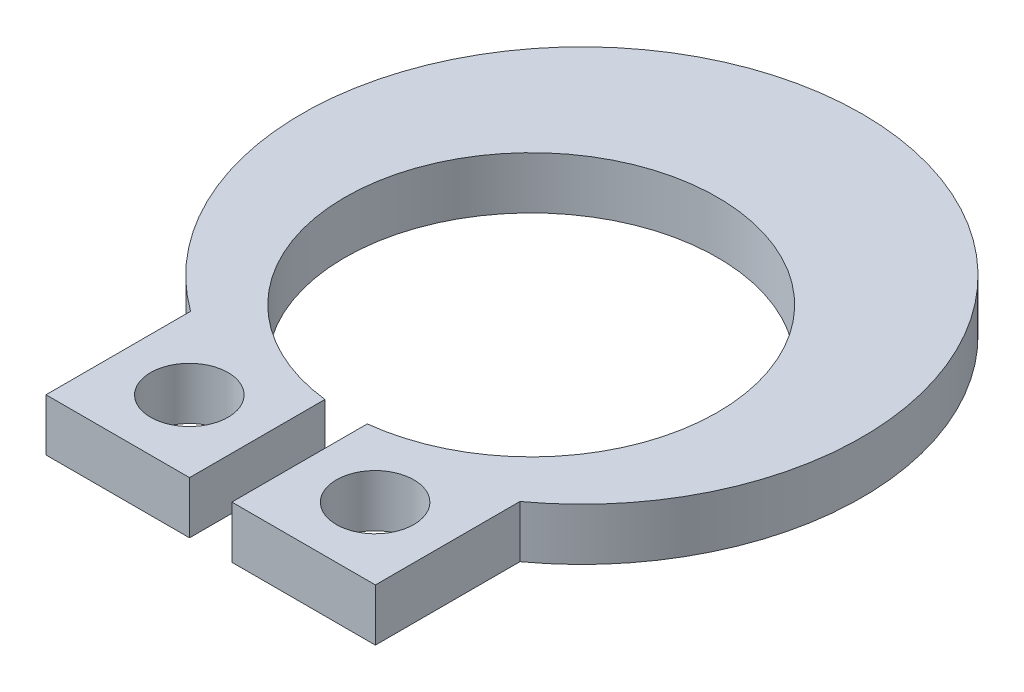
ISO-10303-21;
HEADER;
FILE_DESCRIPTION(('STEP AP214'),'2;1');
FILE_NAME('part.step','',(''),(''),'','','');
FILE_SCHEMA(('AUTOMOTIVE_DESIGN { 1 0 10303 214 1 1 1 1 }'));
ENDSEC;
DATA;
#1=APPLICATION_CONTEXT('core data for automotive mechanical design processes');
#2=APPLICATION_PROTOCOL_DEFINITION('international standard','automotive_design',2000,#1);
#3=PRODUCT_CONTEXT('',#1,'mechanical');
#4=PRODUCT('Part','Part','',(#3));
#5=PRODUCT_RELATED_PRODUCT_CATEGORY('part','',(#4));
#6=PRODUCT_DEFINITION_FORMATION('','',#4);
#7=PRODUCT_DEFINITION_CONTEXT('part definition',#1,'design');
#8=PRODUCT_DEFINITION('design','',#6,#7);
#9=PRODUCT_DEFINITION_SHAPE('','',#8);
#10=(LENGTH_UNIT() NAMED_UNIT(*) SI_UNIT(.MILLI.,.METRE.));
#11=(NAMED_UNIT(*) PLANE_ANGLE_UNIT() SI_UNIT($,.RADIAN.));
#12=(NAMED_UNIT(*) SI_UNIT($,.STERADIAN.) SOLID_ANGLE_UNIT());
#13=UNCERTAINTY_MEASURE_WITH_UNIT(LENGTH_MEASURE(1.E-05),#10,'distance_accuracy_value','');
#14=(GEOMETRIC_REPRESENTATION_CONTEXT(3) GLOBAL_UNCERTAINTY_ASSIGNED_CONTEXT((#13)) GLOBAL_UNIT_ASSIGNED_CONTEXT((#10,
#11,#12)) REPRESENTATION_CONTEXT('',''));
#15=CARTESIAN_POINT('',(0.,0.,0.));
#16=DIRECTION('',(0.,0.,1.));
#17=DIRECTION('',(1.,0.,0.));
#18=AXIS2_PLACEMENT_3D('',#15,#16,#17);
#19=CARTESIAN_POINT('',(0.,0.889,0.));
#20=DIRECTION('',(0.,1.,0.));
#21=DIRECTION('',(0.,0.,1.));
#22=AXIS2_PLACEMENT_3D('',#19,#20,#21);
#23=PLANE('',#22);
#24=CARTESIAN_POINT('',(-1.58294705238043,0.889,4.24322865997993));
#25=DIRECTION('',(0.,-1.,0.));
#26=DIRECTION('',(0.,0.,1.));
#27=AXIS2_PLACEMENT_3D('',#24,#25,#26);
#28=CIRCLE('',#27,0.6604);
#29=CARTESIAN_POINT('',(-1.58294705238043,0.889,4.90362865997993));
#30=VERTEX_POINT('',#29);
#31=EDGE_CURVE('E243',#30,#30,#28,.T.);
#32=ORIENTED_EDGE('',*,*,#31,.T.);
#33=EDGE_LOOP('',(#32));
#34=FACE_BOUND('',#33,.T.);
#35=CARTESIAN_POINT('',(0.,0.889,0.));
#36=DIRECTION('',(0.,-1.,0.));
#37=DIRECTION('',(0.,0.,1.));
#38=AXIS2_PLACEMENT_3D('',#35,#36,#37);
#39=CIRCLE('',#38,3.175);
#40=CARTESIAN_POINT('',(-0.36068,0.889,3.15444685128788));
#41=VERTEX_POINT('',#40);
#42=CARTESIAN_POINT('',(0.36068,0.889,3.15444685128788));
#43=VERTEX_POINT('',#42);
#44=EDGE_CURVE('E150',#41,#43,#39,.T.);
#45=ORIENTED_EDGE('',*,*,#44,.T.);
#46=DIRECTION('',(0.,0.,1.));
#47=VECTOR('',#46,1.);
#48=CARTESIAN_POINT('',(0.360679999999999,0.889,5.46211125));
#49=LINE('',#48,#47);
#50=CARTESIAN_POINT('',(0.360679999999999,0.889,5.46211125));
#51=VERTEX_POINT('',#50);
#52=EDGE_CURVE('E117',#43,#51,#49,.T.);
#53=ORIENTED_EDGE('',*,*,#52,.T.);
#54=DIRECTION('',(1.,0.,0.));
#55=VECTOR('',#54,1.);
#56=CARTESIAN_POINT('',(0.360679999999999,0.889,5.46211125));
#57=LINE('',#56,#55);
#58=CARTESIAN_POINT('',(2.8067,0.889,5.46211125));
#59=VERTEX_POINT('',#58);
#60=EDGE_CURVE('E155',#51,#59,#57,.T.);
#61=ORIENTED_EDGE('',*,*,#60,.T.);
#62=DIRECTION('',(0.,0.,-1.));
#63=VECTOR('',#62,1.);
#64=CARTESIAN_POINT('',(2.8067,0.889,2.99831125));
#65=LINE('',#64,#63);
#66=CARTESIAN_POINT('',(2.8067,0.889,2.99831125));
#67=VERTEX_POINT('',#66);
#68=EDGE_CURVE('E158',#59,#67,#65,.T.);
#69=ORIENTED_EDGE('',*,*,#68,.T.);
#70=CARTESIAN_POINT('',(0.,0.889,-0.8636));
#71=DIRECTION('',(0.,1.,0.));
#72=DIRECTION('',(0.,0.,1.));
#73=AXIS2_PLACEMENT_3D('',#70,#71,#72);
#74=CIRCLE('',#73,4.77408875);
#75=CARTESIAN_POINT('',(-2.8067,0.889,2.99831125));
#76=VERTEX_POINT('',#75);
#77=EDGE_CURVE('E161',#67,#76,#74,.T.);
#78=ORIENTED_EDGE('',*,*,#77,.T.);
#79=DIRECTION('',(0.,0.,1.));
#80=VECTOR('',#79,1.);
#81=CARTESIAN_POINT('',(-2.8067,0.889,2.99831125));
#82=LINE('',#81,#80);
#83=CARTESIAN_POINT('',(-2.8067,0.889,5.46211125));
#84=VERTEX_POINT('',#83);
#85=EDGE_CURVE('E164',#76,#84,#82,.T.);
#86=ORIENTED_EDGE('',*,*,#85,.T.);
#87=DIRECTION('',(1.,0.,0.));
#88=VECTOR('',#87,1.);
#89=CARTESIAN_POINT('',(-2.8067,0.889,5.46211125));
#90=LINE('',#89,#88);
#91=CARTESIAN_POINT('',(-0.360680000000001,0.889,5.46211125));
#92=VERTEX_POINT('',#91);
#93=EDGE_CURVE('E57',#84,#92,#90,.T.);
#94=ORIENTED_EDGE('',*,*,#93,.T.);
#95=DIRECTION('',(0.,0.,-1.));
#96=VECTOR('',#95,1.);
#97=CARTESIAN_POINT('',(-0.360680000000001,0.889,5.46211125));
#98=LINE('',#97,#96);
#99=EDGE_CURVE('E52',#92,#41,#98,.T.);
#100=ORIENTED_EDGE('',*,*,#99,.T.);
#101=EDGE_LOOP('',(#45,#53,#61,#69,#78,#86,#94,#100));
#102=FACE_BOUND('',#101,.T.);
#103=CARTESIAN_POINT('',(1.58294705238043,0.889,4.24322865997993));
#104=DIRECTION('',(0.,1.,0.));
#105=DIRECTION('',(0.,0.,1.));
#106=AXIS2_PLACEMENT_3D('',#103,#104,#105);
#107=CIRCLE('',#106,0.6604);
#108=CARTESIAN_POINT('',(1.58294705238043,0.889,4.90362865997993));
#109=VERTEX_POINT('',#108);
#110=EDGE_CURVE('E123',#109,#109,#107,.T.);
#111=ORIENTED_EDGE('',*,*,#110,.F.);
#112=EDGE_LOOP('',(#111));
#113=FACE_BOUND('',#112,.T.);
#114=ADVANCED_FACE('F36',(#34,#102,#113),#23,.T.);
#115=CARTESIAN_POINT('',(0.,0.,0.));
#116=DIRECTION('',(0.,1.,0.));
#117=DIRECTION('',(0.,0.,1.));
#118=AXIS2_PLACEMENT_3D('',#115,#116,#117);
#119=PLANE('',#118);
#120=CARTESIAN_POINT('',(-1.58294705238043,0.,4.24322865997993));
#121=DIRECTION('',(0.,-1.,0.));
#122=DIRECTION('',(0.,0.,1.));
#123=AXIS2_PLACEMENT_3D('',#120,#121,#122);
#124=CIRCLE('',#123,0.6604);
#125=CARTESIAN_POINT('',(-1.58294705238043,0.,4.90362865997993));
#126=VERTEX_POINT('',#125);
#127=EDGE_CURVE('E246',#126,#126,#124,.T.);
#128=ORIENTED_EDGE('',*,*,#127,.F.);
#129=EDGE_LOOP('',(#128));
#130=FACE_BOUND('',#129,.T.);
#131=CARTESIAN_POINT('',(0.,0.,0.));
#132=DIRECTION('',(0.,-1.,0.));
#133=DIRECTION('',(0.,0.,1.));
#134=AXIS2_PLACEMENT_3D('',#131,#132,#133);
#135=CIRCLE('',#134,3.175);
#136=CARTESIAN_POINT('',(-0.36068,0.,3.15444685128788));
#137=VERTEX_POINT('',#136);
#138=CARTESIAN_POINT('',(0.36068,0.,3.15444685128788));
#139=VERTEX_POINT('',#138);
#140=EDGE_CURVE('E107',#137,#139,#135,.T.);
#141=ORIENTED_EDGE('',*,*,#140,.F.);
#142=DIRECTION('',(0.,0.,-1.));
#143=VECTOR('',#142,1.);
#144=CARTESIAN_POINT('',(-0.360680000000001,0.,5.46211125));
#145=LINE('',#144,#143);
#146=CARTESIAN_POINT('',(-0.360680000000001,0.,5.46211125));
#147=VERTEX_POINT('',#146);
#148=EDGE_CURVE('E147',#147,#137,#145,.T.);
#149=ORIENTED_EDGE('',*,*,#148,.F.);
#150=DIRECTION('',(1.,0.,0.));
#151=VECTOR('',#150,1.);
#152=CARTESIAN_POINT('',(-2.8067,0.,5.46211125));
#153=LINE('',#152,#151);
#154=CARTESIAN_POINT('',(-2.8067,0.,5.46211125));
#155=VERTEX_POINT('',#154);
#156=EDGE_CURVE('E144',#155,#147,#153,.T.);
#157=ORIENTED_EDGE('',*,*,#156,.F.);
#158=DIRECTION('',(0.,0.,1.));
#159=VECTOR('',#158,1.);
#160=CARTESIAN_POINT('',(-2.8067,0.,2.99831125));
#161=LINE('',#160,#159);
#162=CARTESIAN_POINT('',(-2.8067,0.,2.99831125));
#163=VERTEX_POINT('',#162);
#164=EDGE_CURVE('E141',#163,#155,#161,.T.);
#165=ORIENTED_EDGE('',*,*,#164,.F.);
#166=CARTESIAN_POINT('',(0.,0.,-0.8636));
#167=DIRECTION('',(0.,1.,0.));
#168=DIRECTION('',(0.,0.,1.));
#169=AXIS2_PLACEMENT_3D('',#166,#167,#168);
#170=CIRCLE('',#169,4.77408875);
#171=CARTESIAN_POINT('',(2.8067,0.,2.99831125));
#172=VERTEX_POINT('',#171);
#173=EDGE_CURVE('E138',#172,#163,#170,.T.);
#174=ORIENTED_EDGE('',*,*,#173,.F.);
#175=DIRECTION('',(0.,0.,-1.));
#176=VECTOR('',#175,1.);
#177=CARTESIAN_POINT('',(2.8067,0.,2.99831125));
#178=LINE('',#177,#176);
#179=CARTESIAN_POINT('',(2.8067,0.,5.46211125));
#180=VERTEX_POINT('',#179);
#181=EDGE_CURVE('E135',#180,#172,#178,.T.);
#182=ORIENTED_EDGE('',*,*,#181,.F.);
#183=DIRECTION('',(1.,0.,0.));
#184=VECTOR('',#183,1.);
#185=CARTESIAN_POINT('',(0.360679999999999,0.,5.46211125));
#186=LINE('',#185,#184);
#187=CARTESIAN_POINT('',(0.360679999999999,0.,5.46211125));
#188=VERTEX_POINT('',#187);
#189=EDGE_CURVE('E109',#188,#180,#186,.T.);
#190=ORIENTED_EDGE('',*,*,#189,.F.);
#191=DIRECTION('',(0.,0.,1.));
#192=VECTOR('',#191,1.);
#193=CARTESIAN_POINT('',(0.360679999999999,0.,5.46211125));
#194=LINE('',#193,#192);
#195=EDGE_CURVE('E102',#139,#188,#194,.T.);
#196=ORIENTED_EDGE('',*,*,#195,.F.);
#197=EDGE_LOOP('',(#141,#149,#157,#165,#174,#182,#190,#196));
#198=FACE_BOUND('',#197,.T.);
#199=CARTESIAN_POINT('',(1.58294705238043,0.,4.24322865997993));
#200=DIRECTION('',(0.,1.,0.));
#201=DIRECTION('',(0.,0.,1.));
#202=AXIS2_PLACEMENT_3D('',#199,#200,#201);
#203=CIRCLE('',#202,0.6604);
#204=CARTESIAN_POINT('',(1.58294705238043,0.,4.90362865997993));
#205=VERTEX_POINT('',#204);
#206=EDGE_CURVE('E129',#205,#205,#203,.T.);
#207=ORIENTED_EDGE('',*,*,#206,.T.);
#208=EDGE_LOOP('',(#207));
#209=FACE_BOUND('',#208,.T.);
#210=ADVANCED_FACE('F103',(#130,#198,#209),#119,.F.);
#211=CARTESIAN_POINT('',(0.,0.889,0.));
#212=DIRECTION('',(0.,-1.,0.));
#213=DIRECTION('',(0.,0.,-1.));
#214=AXIS2_PLACEMENT_3D('',#211,#212,#213);
#215=CYLINDRICAL_SURFACE('',#214,3.175);
#216=ORIENTED_EDGE('',*,*,#140,.T.);
#217=DIRECTION('',(0.,-1.,0.));
#218=VECTOR('',#217,1.);
#219=CARTESIAN_POINT('',(0.36068,0.889,3.15444685128788));
#220=LINE('',#219,#218);
#221=EDGE_CURVE('E11',#43,#139,#220,.T.);
#222=ORIENTED_EDGE('',*,*,#221,.F.);
#223=ORIENTED_EDGE('',*,*,#44,.F.);
#224=DIRECTION('',(0.,-1.,0.));
#225=VECTOR('',#224,1.);
#226=CARTESIAN_POINT('',(-0.36068,0.889,3.15444685128788));
#227=LINE('',#226,#225);
#228=EDGE_CURVE('E121',#41,#137,#227,.T.);
#229=ORIENTED_EDGE('',*,*,#228,.T.);
#230=EDGE_LOOP('',(#216,#222,#223,#229));
#231=FACE_BOUND('',#230,.T.);
#232=ADVANCED_FACE('F38',(#231),#215,.F.);
#233=CARTESIAN_POINT('',(0.360679999999999,0.889,5.46211125));
#234=DIRECTION('',(1.,0.,0.));
#235=DIRECTION('',(0.,0.,-1.));
#236=AXIS2_PLACEMENT_3D('',#233,#234,#235);
#237=PLANE('',#236);
#238=ORIENTED_EDGE('',*,*,#195,.T.);
#239=DIRECTION('',(0.,-1.,0.));
#240=VECTOR('',#239,1.);
#241=CARTESIAN_POINT('',(0.360679999999999,0.889,5.46211125));
#242=LINE('',#241,#240);
#243=EDGE_CURVE('E45',#51,#188,#242,.T.);
#244=ORIENTED_EDGE('',*,*,#243,.F.);
#245=ORIENTED_EDGE('',*,*,#52,.F.);
#246=ORIENTED_EDGE('',*,*,#221,.T.);
#247=EDGE_LOOP('',(#238,#244,#245,#246));
#248=FACE_BOUND('',#247,.T.);
#249=ADVANCED_FACE('F116',(#248),#237,.F.);
#250=CARTESIAN_POINT('',(0.360679999999999,0.889,5.46211125));
#251=DIRECTION('',(0.,0.,-1.));
#252=DIRECTION('',(-1.,0.,0.));
#253=AXIS2_PLACEMENT_3D('',#250,#251,#252);
#254=PLANE('',#253);
#255=ORIENTED_EDGE('',*,*,#189,.T.);
#256=DIRECTION('',(0.,-1.,0.));
#257=VECTOR('',#256,1.);
#258=CARTESIAN_POINT('',(2.8067,0.889,5.46211125));
#259=LINE('',#258,#257);
#260=EDGE_CURVE('E188',#59,#180,#259,.T.);
#261=ORIENTED_EDGE('',*,*,#260,.F.);
#262=ORIENTED_EDGE('',*,*,#60,.F.);
#263=ORIENTED_EDGE('',*,*,#243,.T.);
#264=EDGE_LOOP('',(#255,#261,#262,#263));
#265=FACE_BOUND('',#264,.T.);
#266=ADVANCED_FACE('F194',(#265),#254,.F.);
#267=CARTESIAN_POINT('',(2.8067,0.889,2.99831125));
#268=DIRECTION('',(-1.,0.,0.));
#269=DIRECTION('',(0.,0.,1.));
#270=AXIS2_PLACEMENT_3D('',#267,#268,#269);
#271=PLANE('',#270);
#272=ORIENTED_EDGE('',*,*,#181,.T.);
#273=DIRECTION('',(0.,-1.,0.));
#274=VECTOR('',#273,1.);
#275=CARTESIAN_POINT('',(2.8067,0.889,2.99831125));
#276=LINE('',#275,#274);
#277=EDGE_CURVE('E184',#67,#172,#276,.T.);
#278=ORIENTED_EDGE('',*,*,#277,.F.);
#279=ORIENTED_EDGE('',*,*,#68,.F.);
#280=ORIENTED_EDGE('',*,*,#260,.T.);
#281=EDGE_LOOP('',(#272,#278,#279,#280));
#282=FACE_BOUND('',#281,.T.);
#283=ADVANCED_FACE('F202',(#282),#271,.F.);
#284=CARTESIAN_POINT('',(0.,0.889,-0.8636));
#285=DIRECTION('',(0.,-1.,0.));
#286=DIRECTION('',(0.,0.,-1.));
#287=AXIS2_PLACEMENT_3D('',#284,#285,#286);
#288=CYLINDRICAL_SURFACE('',#287,4.77408875);
#289=ORIENTED_EDGE('',*,*,#173,.T.);
#290=DIRECTION('',(0.,-1.,0.));
#291=VECTOR('',#290,1.);
#292=CARTESIAN_POINT('',(-2.8067,0.889,2.99831125));
#293=LINE('',#292,#291);
#294=EDGE_CURVE('E181',#76,#163,#293,.T.);
#295=ORIENTED_EDGE('',*,*,#294,.F.);
#296=ORIENTED_EDGE('',*,*,#77,.F.);
#297=ORIENTED_EDGE('',*,*,#277,.T.);
#298=EDGE_LOOP('',(#289,#295,#296,#297));
#299=FACE_BOUND('',#298,.T.);
#300=ADVANCED_FACE('F205',(#299),#288,.T.);
#301=CARTESIAN_POINT('',(-2.8067,0.889,2.99831125));
#302=DIRECTION('',(1.,0.,0.));
#303=DIRECTION('',(0.,0.,-1.));
#304=AXIS2_PLACEMENT_3D('',#301,#302,#303);
#305=PLANE('',#304);
#306=ORIENTED_EDGE('',*,*,#164,.T.);
#307=DIRECTION('',(0.,-1.,0.));
#308=VECTOR('',#307,1.);
#309=CARTESIAN_POINT('',(-2.8067,0.889,5.46211125));
#310=LINE('',#309,#308);
#311=EDGE_CURVE('E177',#84,#155,#310,.T.);
#312=ORIENTED_EDGE('',*,*,#311,.F.);
#313=ORIENTED_EDGE('',*,*,#85,.F.);
#314=ORIENTED_EDGE('',*,*,#294,.T.);
#315=EDGE_LOOP('',(#306,#312,#313,#314));
#316=FACE_BOUND('',#315,.T.);
#317=ADVANCED_FACE('F210',(#316),#305,.F.);
#318=CARTESIAN_POINT('',(-2.8067,0.889,5.46211125));
#319=DIRECTION('',(0.,0.,-1.));
#320=DIRECTION('',(-1.,0.,0.));
#321=AXIS2_PLACEMENT_3D('',#318,#319,#320);
#322=PLANE('',#321);
#323=ORIENTED_EDGE('',*,*,#156,.T.);
#324=DIRECTION('',(0.,-1.,0.));
#325=VECTOR('',#324,1.);
#326=CARTESIAN_POINT('',(-0.360680000000001,0.889,5.46211125));
#327=LINE('',#326,#325);
#328=EDGE_CURVE('E173',#92,#147,#327,.T.);
#329=ORIENTED_EDGE('',*,*,#328,.F.);
#330=ORIENTED_EDGE('',*,*,#93,.F.);
#331=ORIENTED_EDGE('',*,*,#311,.T.);
#332=EDGE_LOOP('',(#323,#329,#330,#331));
#333=FACE_BOUND('',#332,.T.);
#334=ADVANCED_FACE('F213',(#333),#322,.F.);
#335=CARTESIAN_POINT('',(-0.360680000000001,0.889,5.46211125));
#336=DIRECTION('',(-1.,0.,0.));
#337=DIRECTION('',(0.,0.,1.));
#338=AXIS2_PLACEMENT_3D('',#335,#336,#337);
#339=PLANE('',#338);
#340=ORIENTED_EDGE('',*,*,#148,.T.);
#341=ORIENTED_EDGE('',*,*,#228,.F.);
#342=ORIENTED_EDGE('',*,*,#99,.F.);
#343=ORIENTED_EDGE('',*,*,#328,.T.);
#344=EDGE_LOOP('',(#340,#341,#342,#343));
#345=FACE_BOUND('',#344,.T.);
#346=ADVANCED_FACE('F215',(#345),#339,.F.);
#347=CARTESIAN_POINT('',(1.58294705238043,0.889,4.24322865997993));
#348=DIRECTION('',(0.,-1.,0.));
#349=DIRECTION('',(0.,0.,-1.));
#350=AXIS2_PLACEMENT_3D('',#347,#348,#349);
#351=CYLINDRICAL_SURFACE('',#350,0.6604);
#352=ORIENTED_EDGE('',*,*,#110,.T.);
#353=EDGE_LOOP('',(#352));
#354=FACE_BOUND('',#353,.T.);
#355=ORIENTED_EDGE('',*,*,#206,.F.);
#356=EDGE_LOOP('',(#355));
#357=FACE_BOUND('',#356,.T.);
#358=ADVANCED_FACE('F217',(#354,#357),#351,.F.);
#359=CARTESIAN_POINT('',(-1.58294705238043,0.889,4.24322865997993));
#360=DIRECTION('',(0.,-1.,0.));
#361=DIRECTION('',(0.,0.,-1.));
#362=AXIS2_PLACEMENT_3D('',#359,#360,#361);
#363=CYLINDRICAL_SURFACE('',#362,0.6604);
#364=ORIENTED_EDGE('',*,*,#31,.F.);
#365=EDGE_LOOP('',(#364));
#366=FACE_BOUND('',#365,.T.);
#367=ORIENTED_EDGE('',*,*,#127,.T.);
#368=EDGE_LOOP('',(#367));
#369=FACE_BOUND('',#368,.T.);
#370=ADVANCED_FACE('F223',(#366,#369),#363,.F.);
#371=CLOSED_SHELL('',(#114,#210,#232,#249,#266,#283,#300,#317,#334,#346,#358,#370));
#372=MANIFOLD_SOLID_BREP('B2',#371);
#373=ADVANCED_BREP_SHAPE_REPRESENTATION('',(#18,#372),#14);
#374=SHAPE_DEFINITION_REPRESENTATION(#9,#373);
ENDSEC;
END-ISO-10303-21;
